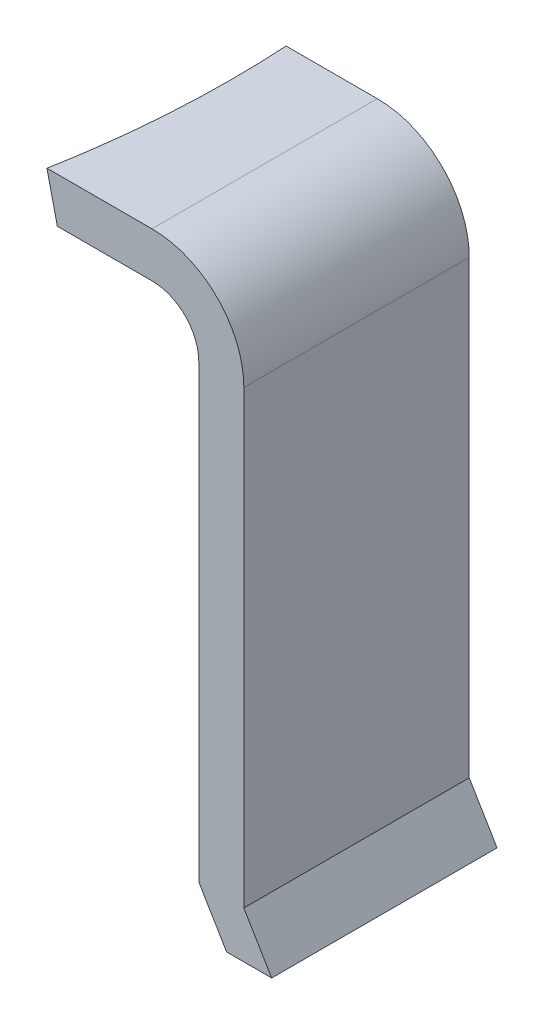
ISO-10303-21;
HEADER;
FILE_DESCRIPTION(('STEP AP214'),'2;1');
FILE_NAME('part.step','',(''),(''),'','','');
FILE_SCHEMA(('AUTOMOTIVE_DESIGN { 1 0 10303 214 1 1 1 1 }'));
ENDSEC;
DATA;
#1=APPLICATION_CONTEXT('core data for automotive mechanical design processes');
#2=APPLICATION_PROTOCOL_DEFINITION('international standard','automotive_design',2000,#1);
#3=PRODUCT_CONTEXT('',#1,'mechanical');
#4=PRODUCT('Part','Part','',(#3));
#5=PRODUCT_RELATED_PRODUCT_CATEGORY('part','',(#4));
#6=PRODUCT_DEFINITION_FORMATION('','',#4);
#7=PRODUCT_DEFINITION_CONTEXT('part definition',#1,'design');
#8=PRODUCT_DEFINITION('design','',#6,#7);
#9=PRODUCT_DEFINITION_SHAPE('','',#8);
#10=(LENGTH_UNIT() NAMED_UNIT(*) SI_UNIT(.MILLI.,.METRE.));
#11=(NAMED_UNIT(*) PLANE_ANGLE_UNIT() SI_UNIT($,.RADIAN.));
#12=(NAMED_UNIT(*) SI_UNIT($,.STERADIAN.) SOLID_ANGLE_UNIT());
#13=UNCERTAINTY_MEASURE_WITH_UNIT(LENGTH_MEASURE(1.E-05),#10,'distance_accuracy_value','');
#14=(GEOMETRIC_REPRESENTATION_CONTEXT(3) GLOBAL_UNCERTAINTY_ASSIGNED_CONTEXT((#13)) GLOBAL_UNIT_ASSIGNED_CONTEXT((#10,
#11,#12)) REPRESENTATION_CONTEXT('',''));
#15=CARTESIAN_POINT('',(0.,0.,0.));
#16=DIRECTION('',(0.,0.,1.));
#17=DIRECTION('',(1.,0.,0.));
#18=AXIS2_PLACEMENT_3D('',#15,#16,#17);
#19=CARTESIAN_POINT('',(-4.33181805382979,20.6183362894142,10.));
#20=DIRECTION('',(0.,0.,1.));
#21=DIRECTION('',(1.,0.,0.));
#22=AXIS2_PLACEMENT_3D('',#19,#20,#21);
#23=PLANE('',#22);
#24=DIRECTION('',(1.,0.,0.));
#25=VECTOR('',#24,1.);
#26=CARTESIAN_POINT('',(-9.35349036472429,24.6748324260027,10.));
#27=LINE('',#26,#25);
#28=CARTESIAN_POINT('',(-9.01172973522732,24.6748324260027,10.));
#29=VERTEX_POINT('',#28);
#30=CARTESIAN_POINT('',(-4.35349036472429,24.6748324260027,10.));
#31=VERTEX_POINT('',#30);
#32=EDGE_CURVE('E185',#29,#31,#27,.T.);
#33=ORIENTED_EDGE('',*,*,#32,.F.);
#34=DIRECTION('',(0.224951054343858,-0.974370064785237,0.));
#35=VECTOR('',#34,1.);
#36=CARTESIAN_POINT('',(-9.27054636411895,25.7958904099105,10.));
#37=LINE('',#36,#35);
#38=CARTESIAN_POINT('',(-8.54998035432093,22.6747761226411,10.));
#39=VERTEX_POINT('',#38);
#40=EDGE_CURVE('E47',#29,#39,#37,.T.);
#41=ORIENTED_EDGE('',*,*,#40,.T.);
#42=DIRECTION('',(1.,0.,0.));
#43=VECTOR('',#42,1.);
#44=CARTESIAN_POINT('',(-9.35349036472429,22.6747761226411,10.));
#45=LINE('',#44,#43);
#46=CARTESIAN_POINT('',(-4.35349036472429,22.6747761226411,10.));
#47=VERTEX_POINT('',#46);
#48=EDGE_CURVE('E187',#39,#47,#45,.T.);
#49=ORIENTED_EDGE('',*,*,#48,.T.);
#50=CARTESIAN_POINT('',(-4.33181805382979,20.6183362894142,10.));
#51=DIRECTION('',(0.,0.,-1.));
#52=DIRECTION('',(1.,0.,0.));
#53=AXIS2_PLACEMENT_3D('',#50,#51,#52);
#54=CIRCLE('',#53,2.05655402961891);
#55=CARTESIAN_POINT('',(-2.27526402421088,20.6183362894142,10.));
#56=VERTEX_POINT('',#55);
#57=EDGE_CURVE('E117',#47,#56,#54,.T.);
#58=ORIENTED_EDGE('',*,*,#57,.T.);
#59=DIRECTION('',(0.,-1.,0.));
#60=VECTOR('',#59,1.);
#61=CARTESIAN_POINT('',(-2.27526402421088,20.6183362894142,10.));
#62=LINE('',#61,#60);
#63=CARTESIAN_POINT('',(-2.27526402421088,0.61833628941416,10.));
#64=VERTEX_POINT('',#63);
#65=EDGE_CURVE('E110',#56,#64,#62,.T.);
#66=ORIENTED_EDGE('',*,*,#65,.T.);
#67=DIRECTION('',(0.511795268473,-0.859107445648477,0.));
#68=VECTOR('',#67,1.);
#69=CARTESIAN_POINT('',(-1.04058625815568,-1.45421288627367,10.));
#70=LINE('',#69,#68);
#71=CARTESIAN_POINT('',(-1.04058625815568,-1.45421288627367,10.));
#72=VERTEX_POINT('',#71);
#73=EDGE_CURVE('E114',#64,#72,#70,.T.);
#74=ORIENTED_EDGE('',*,*,#73,.T.);
#75=DIRECTION('',(1.,0.,0.));
#76=VECTOR('',#75,1.);
#77=CARTESIAN_POINT('',(0.95941374184432,-1.45421288627367,10.));
#78=LINE('',#77,#76);
#79=CARTESIAN_POINT('',(0.95941374184432,-1.45421288627367,10.));
#80=VERTEX_POINT('',#79);
#81=EDGE_CURVE('E56',#72,#80,#78,.T.);
#82=ORIENTED_EDGE('',*,*,#81,.T.);
#83=DIRECTION('',(-0.511795268473,0.859107445648476,0.));
#84=VECTOR('',#83,1.);
#85=CARTESIAN_POINT('',(-0.275264024210878,0.61833628941416,10.));
#86=LINE('',#85,#84);
#87=CARTESIAN_POINT('',(-0.275264024210878,0.61833628941416,10.));
#88=VERTEX_POINT('',#87);
#89=EDGE_CURVE('E153',#80,#88,#86,.T.);
#90=ORIENTED_EDGE('',*,*,#89,.T.);
#91=DIRECTION('',(0.,1.,0.));
#92=VECTOR('',#91,1.);
#93=CARTESIAN_POINT('',(-0.275264024210878,0.61833628941416,10.));
#94=LINE('',#93,#92);
#95=CARTESIAN_POINT('',(-0.275264024210878,20.6183362894142,10.));
#96=VERTEX_POINT('',#95);
#97=EDGE_CURVE('E95',#88,#96,#94,.T.);
#98=ORIENTED_EDGE('',*,*,#97,.T.);
#99=CARTESIAN_POINT('',(-4.33181805382979,20.6183362894142,10.));
#100=DIRECTION('',(0.,0.,1.));
#101=DIRECTION('',(1.,0.,0.));
#102=AXIS2_PLACEMENT_3D('',#99,#100,#101);
#103=CIRCLE('',#102,4.05655402961891);
#104=EDGE_CURVE('E189',#96,#31,#103,.T.);
#105=ORIENTED_EDGE('',*,*,#104,.T.);
#106=EDGE_LOOP('',(#33,#41,#49,#58,#66,#74,#82,#90,#98,#105));
#107=FACE_BOUND('',#106,.T.);
#108=ADVANCED_FACE('F33',(#107),#23,.T.);
#109=CARTESIAN_POINT('',(-4.33181805382979,20.6183362894142,0.));
#110=DIRECTION('',(0.,0.,1.));
#111=DIRECTION('',(1.,0.,0.));
#112=AXIS2_PLACEMENT_3D('',#109,#110,#111);
#113=PLANE('',#112);
#114=DIRECTION('',(0.224951054343858,-0.974370064785237,0.));
#115=VECTOR('',#114,1.);
#116=CARTESIAN_POINT('',(-8.69234976529121,25.9293776127968,0.));
#117=LINE('',#116,#115);
#118=CARTESIAN_POINT('',(-8.4027151873308,24.6748324260027,0.));
#119=VERTEX_POINT('',#118);
#120=CARTESIAN_POINT('',(-7.94096580642442,22.6747761226411,0.));
#121=VERTEX_POINT('',#120);
#122=EDGE_CURVE('E200',#119,#121,#117,.T.);
#123=ORIENTED_EDGE('',*,*,#122,.F.);
#124=DIRECTION('',(1.,0.,0.));
#125=VECTOR('',#124,1.);
#126=CARTESIAN_POINT('',(-9.35349036472429,24.6748324260027,0.));
#127=LINE('',#126,#125);
#128=CARTESIAN_POINT('',(-4.35349036472429,24.6748324260027,0.));
#129=VERTEX_POINT('',#128);
#130=EDGE_CURVE('E176',#119,#129,#127,.T.);
#131=ORIENTED_EDGE('',*,*,#130,.T.);
#132=CARTESIAN_POINT('',(-4.33181805382979,20.6183362894142,0.));
#133=DIRECTION('',(0.,0.,1.));
#134=DIRECTION('',(1.,0.,0.));
#135=AXIS2_PLACEMENT_3D('',#132,#133,#134);
#136=CIRCLE('',#135,4.05655402961891);
#137=CARTESIAN_POINT('',(-0.275264024210878,20.6183362894142,0.));
#138=VERTEX_POINT('',#137);
#139=EDGE_CURVE('E144',#138,#129,#136,.T.);
#140=ORIENTED_EDGE('',*,*,#139,.F.);
#141=DIRECTION('',(0.,1.,0.));
#142=VECTOR('',#141,1.);
#143=CARTESIAN_POINT('',(-0.275264024210878,0.61833628941416,0.));
#144=LINE('',#143,#142);
#145=CARTESIAN_POINT('',(-0.275264024210878,0.61833628941416,0.));
#146=VERTEX_POINT('',#145);
#147=EDGE_CURVE('E141',#146,#138,#144,.T.);
#148=ORIENTED_EDGE('',*,*,#147,.F.);
#149=DIRECTION('',(-0.511795268473,0.859107445648476,0.));
#150=VECTOR('',#149,1.);
#151=CARTESIAN_POINT('',(-0.275264024210878,0.61833628941416,0.));
#152=LINE('',#151,#150);
#153=CARTESIAN_POINT('',(0.95941374184432,-1.45421288627367,0.));
#154=VERTEX_POINT('',#153);
#155=EDGE_CURVE('E138',#154,#146,#152,.T.);
#156=ORIENTED_EDGE('',*,*,#155,.F.);
#157=DIRECTION('',(1.,0.,0.));
#158=VECTOR('',#157,1.);
#159=CARTESIAN_POINT('',(0.95941374184432,-1.45421288627367,0.));
#160=LINE('',#159,#158);
#161=CARTESIAN_POINT('',(-1.04058625815568,-1.45421288627367,0.));
#162=VERTEX_POINT('',#161);
#163=EDGE_CURVE('E86',#162,#154,#160,.T.);
#164=ORIENTED_EDGE('',*,*,#163,.F.);
#165=DIRECTION('',(0.511795268473,-0.859107445648477,0.));
#166=VECTOR('',#165,1.);
#167=CARTESIAN_POINT('',(-1.04058625815568,-1.45421288627367,0.));
#168=LINE('',#167,#166);
#169=CARTESIAN_POINT('',(-2.27526402421088,0.61833628941416,0.));
#170=VERTEX_POINT('',#169);
#171=EDGE_CURVE('E150',#170,#162,#168,.T.);
#172=ORIENTED_EDGE('',*,*,#171,.F.);
#173=DIRECTION('',(0.,-1.,0.));
#174=VECTOR('',#173,1.);
#175=CARTESIAN_POINT('',(-2.27526402421088,20.6183362894142,0.));
#176=LINE('',#175,#174);
#177=CARTESIAN_POINT('',(-2.27526402421088,20.6183362894142,0.));
#178=VERTEX_POINT('',#177);
#179=EDGE_CURVE('E126',#178,#170,#176,.T.);
#180=ORIENTED_EDGE('',*,*,#179,.F.);
#181=CARTESIAN_POINT('',(-4.33181805382979,20.6183362894142,0.));
#182=DIRECTION('',(0.,0.,-1.));
#183=DIRECTION('',(1.,0.,0.));
#184=AXIS2_PLACEMENT_3D('',#181,#182,#183);
#185=CIRCLE('',#184,2.05655402961891);
#186=CARTESIAN_POINT('',(-4.35349036472429,22.6747761226411,0.));
#187=VERTEX_POINT('',#186);
#188=EDGE_CURVE('E147',#187,#178,#185,.T.);
#189=ORIENTED_EDGE('',*,*,#188,.F.);
#190=DIRECTION('',(1.,0.,0.));
#191=VECTOR('',#190,1.);
#192=CARTESIAN_POINT('',(-9.35349036472429,22.6747761226411,0.));
#193=LINE('',#192,#191);
#194=EDGE_CURVE('E142',#121,#187,#193,.T.);
#195=ORIENTED_EDGE('',*,*,#194,.F.);
#196=EDGE_LOOP('',(#123,#131,#140,#148,#156,#164,#172,#180,#189,#195));
#197=FACE_BOUND('',#196,.T.);
#198=ADVANCED_FACE('F172',(#197),#113,.F.);
#199=CARTESIAN_POINT('',(-0.275264024210878,0.61833628941416,10.));
#200=DIRECTION('',(-0.859107445648477,-0.511795268473,0.));
#201=DIRECTION('',(0.511795268473,-0.859107445648477,0.));
#202=AXIS2_PLACEMENT_3D('',#199,#200,#201);
#203=PLANE('',#202);
#204=ORIENTED_EDGE('',*,*,#155,.T.);
#205=DIRECTION('',(0.,0.,-1.));
#206=VECTOR('',#205,1.);
#207=CARTESIAN_POINT('',(-0.275264024210878,0.61833628941416,10.));
#208=LINE('',#207,#206);
#209=EDGE_CURVE('E41',#88,#146,#208,.T.);
#210=ORIENTED_EDGE('',*,*,#209,.F.);
#211=ORIENTED_EDGE('',*,*,#89,.F.);
#212=DIRECTION('',(0.,0.,-1.));
#213=VECTOR('',#212,1.);
#214=CARTESIAN_POINT('',(0.95941374184432,-1.45421288627367,10.));
#215=LINE('',#214,#213);
#216=EDGE_CURVE('E134',#80,#154,#215,.T.);
#217=ORIENTED_EDGE('',*,*,#216,.T.);
#218=EDGE_LOOP('',(#204,#210,#211,#217));
#219=FACE_BOUND('',#218,.T.);
#220=ADVANCED_FACE('F35',(#219),#203,.F.);
#221=CARTESIAN_POINT('',(-0.275264024210878,0.61833628941416,10.));
#222=DIRECTION('',(-1.,0.,0.));
#223=DIRECTION('',(0.,-1.,0.));
#224=AXIS2_PLACEMENT_3D('',#221,#222,#223);
#225=PLANE('',#224);
#226=ORIENTED_EDGE('',*,*,#147,.T.);
#227=DIRECTION('',(0.,0.,-1.));
#228=VECTOR('',#227,1.);
#229=CARTESIAN_POINT('',(-0.275264024210878,20.6183362894142,10.));
#230=LINE('',#229,#228);
#231=EDGE_CURVE('E163',#96,#138,#230,.T.);
#232=ORIENTED_EDGE('',*,*,#231,.F.);
#233=ORIENTED_EDGE('',*,*,#97,.F.);
#234=ORIENTED_EDGE('',*,*,#209,.T.);
#235=EDGE_LOOP('',(#226,#232,#233,#234));
#236=FACE_BOUND('',#235,.T.);
#237=ADVANCED_FACE('F166',(#236),#225,.F.);
#238=CARTESIAN_POINT('',(-4.33181805382979,20.6183362894142,10.));
#239=DIRECTION('',(0.,0.,-1.));
#240=DIRECTION('',(-1.,0.,0.));
#241=AXIS2_PLACEMENT_3D('',#238,#239,#240);
#242=CYLINDRICAL_SURFACE('',#241,4.05655402961891);
#243=ORIENTED_EDGE('',*,*,#139,.T.);
#244=DIRECTION('',(0.,0.,-1.));
#245=VECTOR('',#244,1.);
#246=CARTESIAN_POINT('',(-4.35349036472429,24.6748324260027,10.));
#247=LINE('',#246,#245);
#248=EDGE_CURVE('E160',#31,#129,#247,.T.);
#249=ORIENTED_EDGE('',*,*,#248,.F.);
#250=ORIENTED_EDGE('',*,*,#104,.F.);
#251=ORIENTED_EDGE('',*,*,#231,.T.);
#252=EDGE_LOOP('',(#243,#249,#250,#251));
#253=FACE_BOUND('',#252,.T.);
#254=ADVANCED_FACE('F179',(#253),#242,.T.);
#255=CARTESIAN_POINT('',(-4.33181805382979,20.6183362894142,10.));
#256=DIRECTION('',(0.,0.,-1.));
#257=DIRECTION('',(-1.,0.,0.));
#258=AXIS2_PLACEMENT_3D('',#255,#256,#257);
#259=CYLINDRICAL_SURFACE('',#258,2.05655402961891);
#260=ORIENTED_EDGE('',*,*,#188,.T.);
#261=DIRECTION('',(0.,0.,-1.));
#262=VECTOR('',#261,1.);
#263=CARTESIAN_POINT('',(-2.27526402421088,20.6183362894142,10.));
#264=LINE('',#263,#262);
#265=EDGE_CURVE('E129',#56,#178,#264,.T.);
#266=ORIENTED_EDGE('',*,*,#265,.F.);
#267=ORIENTED_EDGE('',*,*,#57,.F.);
#268=DIRECTION('',(0.,0.,-1.));
#269=VECTOR('',#268,1.);
#270=CARTESIAN_POINT('',(-4.35349036472429,22.6747761226411,10.));
#271=LINE('',#270,#269);
#272=EDGE_CURVE('E157',#47,#187,#271,.T.);
#273=ORIENTED_EDGE('',*,*,#272,.T.);
#274=EDGE_LOOP('',(#260,#266,#267,#273));
#275=FACE_BOUND('',#274,.T.);
#276=ADVANCED_FACE('F213',(#275),#259,.F.);
#277=CARTESIAN_POINT('',(-2.27526402421088,20.6183362894142,10.));
#278=DIRECTION('',(1.,0.,0.));
#279=DIRECTION('',(0.,1.,0.));
#280=AXIS2_PLACEMENT_3D('',#277,#278,#279);
#281=PLANE('',#280);
#282=ORIENTED_EDGE('',*,*,#179,.T.);
#283=DIRECTION('',(0.,0.,-1.));
#284=VECTOR('',#283,1.);
#285=CARTESIAN_POINT('',(-2.27526402421088,0.61833628941416,10.));
#286=LINE('',#285,#284);
#287=EDGE_CURVE('E123',#64,#170,#286,.T.);
#288=ORIENTED_EDGE('',*,*,#287,.F.);
#289=ORIENTED_EDGE('',*,*,#65,.F.);
#290=ORIENTED_EDGE('',*,*,#265,.T.);
#291=EDGE_LOOP('',(#282,#288,#289,#290));
#292=FACE_BOUND('',#291,.T.);
#293=ADVANCED_FACE('F124',(#292),#281,.F.);
#294=CARTESIAN_POINT('',(-1.04058625815568,-1.45421288627367,10.));
#295=DIRECTION('',(0.859107445648477,0.511795268473,0.));
#296=DIRECTION('',(-0.511795268473,0.859107445648477,0.));
#297=AXIS2_PLACEMENT_3D('',#294,#295,#296);
#298=PLANE('',#297);
#299=ORIENTED_EDGE('',*,*,#171,.T.);
#300=DIRECTION('',(0.,0.,-1.));
#301=VECTOR('',#300,1.);
#302=CARTESIAN_POINT('',(-1.04058625815568,-1.45421288627367,10.));
#303=LINE('',#302,#301);
#304=EDGE_CURVE('E130',#72,#162,#303,.T.);
#305=ORIENTED_EDGE('',*,*,#304,.F.);
#306=ORIENTED_EDGE('',*,*,#73,.F.);
#307=ORIENTED_EDGE('',*,*,#287,.T.);
#308=EDGE_LOOP('',(#299,#305,#306,#307));
#309=FACE_BOUND('',#308,.T.);
#310=ADVANCED_FACE('F132',(#309),#298,.F.);
#311=CARTESIAN_POINT('',(0.95941374184432,-1.45421288627367,10.));
#312=DIRECTION('',(0.,1.,0.));
#313=DIRECTION('',(-1.,0.,0.));
#314=AXIS2_PLACEMENT_3D('',#311,#312,#313);
#315=PLANE('',#314);
#316=ORIENTED_EDGE('',*,*,#163,.T.);
#317=ORIENTED_EDGE('',*,*,#216,.F.);
#318=ORIENTED_EDGE('',*,*,#81,.F.);
#319=ORIENTED_EDGE('',*,*,#304,.T.);
#320=EDGE_LOOP('',(#316,#317,#318,#319));
#321=FACE_BOUND('',#320,.T.);
#322=ADVANCED_FACE('F231',(#321),#315,.F.);
#323=CARTESIAN_POINT('',(-9.35349036472429,22.6747761226411,0.));
#324=DIRECTION('',(0.,1.,0.));
#325=DIRECTION('',(0.,0.,1.));
#326=AXIS2_PLACEMENT_3D('',#323,#324,#325);
#327=PLANE('',#326);
#328=CARTESIAN_POINT('',(-51.4833614572434,22.6747761226411,2.5));
#329=DIRECTION('',(0.,1.,0.));
#330=DIRECTION('',(1.,0.,0.));
#331=AXIS2_PLACEMENT_3D('',#328,#329,#330);
#332=ELLIPSE('',#331,43.6179245812191,42.5);
#333=EDGE_CURVE('E197',#121,#39,#332,.F.);
#334=ORIENTED_EDGE('',*,*,#333,.F.);
#335=ORIENTED_EDGE('',*,*,#194,.T.);
#336=ORIENTED_EDGE('',*,*,#272,.F.);
#337=ORIENTED_EDGE('',*,*,#48,.F.);
#338=EDGE_LOOP('',(#334,#335,#336,#337));
#339=FACE_BOUND('',#338,.T.);
#340=ADVANCED_FACE('F209',(#339),#327,.F.);
#341=CARTESIAN_POINT('',(-9.35349036472429,24.6748324260027,0.));
#342=DIRECTION('',(0.,-1.,0.));
#343=DIRECTION('',(0.,0.,-1.));
#344=AXIS2_PLACEMENT_3D('',#341,#342,#343);
#345=PLANE('',#344);
#346=CARTESIAN_POINT('',(-51.9451108381498,24.6748324260027,2.5));
#347=DIRECTION('',(0.,-1.,0.));
#348=DIRECTION('',(1.,0.,0.));
#349=AXIS2_PLACEMENT_3D('',#346,#347,#348);
#350=ELLIPSE('',#349,43.6179245812191,42.5);
#351=EDGE_CURVE('E11',#29,#119,#350,.F.);
#352=ORIENTED_EDGE('',*,*,#351,.F.);
#353=ORIENTED_EDGE('',*,*,#32,.T.);
#354=ORIENTED_EDGE('',*,*,#248,.T.);
#355=ORIENTED_EDGE('',*,*,#130,.F.);
#356=EDGE_LOOP('',(#352,#353,#354,#355));
#357=FACE_BOUND('',#356,.T.);
#358=ADVANCED_FACE('F183',(#357),#345,.F.);
#359=CARTESIAN_POINT('',(-50.0313705769802,16.3855126551004,2.5));
#360=DIRECTION('',(0.224951054343858,-0.974370064785237,0.));
#361=DIRECTION('',(0.974370064785237,0.224951054343858,0.));
#362=AXIS2_PLACEMENT_3D('',#359,#360,#361);
#363=CYLINDRICAL_SURFACE('',#362,42.5);
#364=ORIENTED_EDGE('',*,*,#333,.T.);
#365=ORIENTED_EDGE('',*,*,#40,.F.);
#366=ORIENTED_EDGE('',*,*,#351,.T.);
#367=ORIENTED_EDGE('',*,*,#122,.T.);
#368=EDGE_LOOP('',(#364,#365,#366,#367));
#369=FACE_BOUND('',#368,.T.);
#370=ADVANCED_FACE('F204',(#369),#363,.F.);
#371=CLOSED_SHELL('',(#108,#198,#220,#237,#254,#276,#293,#310,#322,#340,#358,#370));
#372=MANIFOLD_SOLID_BREP('B2',#371);
#373=ADVANCED_BREP_SHAPE_REPRESENTATION('',(#18,#372),#14);
#374=SHAPE_DEFINITION_REPRESENTATION(#9,#373);
ENDSEC;
END-ISO-10303-21;
